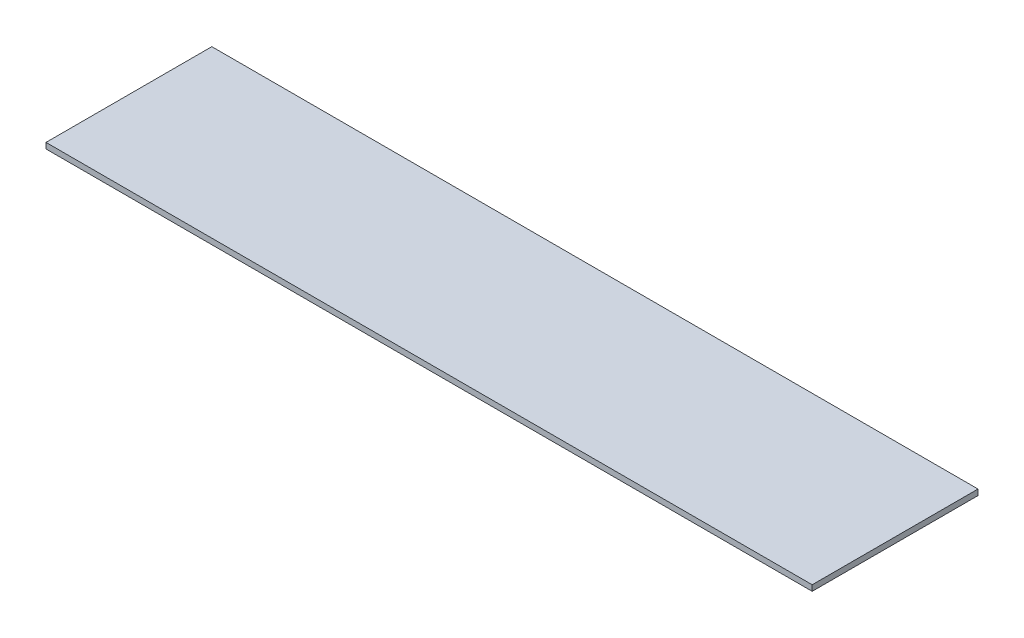
ISO-10303-21;
HEADER;
FILE_DESCRIPTION(('STEP AP214'),'2;1');
FILE_NAME('part.step','',(''),(''),'','','');
FILE_SCHEMA(('AUTOMOTIVE_DESIGN { 1 0 10303 214 1 1 1 1 }'));
ENDSEC;
DATA;
#1=APPLICATION_CONTEXT('core data for automotive mechanical design processes');
#2=APPLICATION_PROTOCOL_DEFINITION('international standard','automotive_design',2000,#1);
#3=PRODUCT_CONTEXT('',#1,'mechanical');
#4=PRODUCT('Part','Part','',(#3));
#5=PRODUCT_RELATED_PRODUCT_CATEGORY('part','',(#4));
#6=PRODUCT_DEFINITION_FORMATION('','',#4);
#7=PRODUCT_DEFINITION_CONTEXT('part definition',#1,'design');
#8=PRODUCT_DEFINITION('design','',#6,#7);
#9=PRODUCT_DEFINITION_SHAPE('','',#8);
#10=(LENGTH_UNIT() NAMED_UNIT(*) SI_UNIT(.MILLI.,.METRE.));
#11=(NAMED_UNIT(*) PLANE_ANGLE_UNIT() SI_UNIT($,.RADIAN.));
#12=(NAMED_UNIT(*) SI_UNIT($,.STERADIAN.) SOLID_ANGLE_UNIT());
#13=UNCERTAINTY_MEASURE_WITH_UNIT(LENGTH_MEASURE(1.E-05),#10,'distance_accuracy_value','');
#14=(GEOMETRIC_REPRESENTATION_CONTEXT(3) GLOBAL_UNCERTAINTY_ASSIGNED_CONTEXT((#13)) GLOBAL_UNIT_ASSIGNED_CONTEXT((#10,
#11,#12)) REPRESENTATION_CONTEXT('',''));
#15=CARTESIAN_POINT('',(0.,0.,0.));
#16=DIRECTION('',(0.,0.,1.));
#17=DIRECTION('',(1.,0.,0.));
#18=AXIS2_PLACEMENT_3D('',#15,#16,#17);
#19=CARTESIAN_POINT('',(-1303.89587580367,6.64285714285715,290.));
#20=DIRECTION('',(1.,0.,0.));
#21=DIRECTION('',(0.,0.,-1.));
#22=AXIS2_PLACEMENT_3D('',#19,#20,#21);
#23=PLANE('',#22);
#24=DIRECTION('',(0.,-1.,0.));
#25=VECTOR('',#24,1.);
#26=CARTESIAN_POINT('',(-1303.89587580367,6.64285714285715,0.));
#27=LINE('',#26,#25);
#28=CARTESIAN_POINT('',(-1303.89587580367,6.64285714285715,0.));
#29=VERTEX_POINT('',#28);
#30=CARTESIAN_POINT('',(-1303.89587580367,-3.35714285714286,0.));
#31=VERTEX_POINT('',#30);
#32=EDGE_CURVE('E96',#29,#31,#27,.T.);
#33=ORIENTED_EDGE('',*,*,#32,.T.);
#34=DIRECTION('',(0.,0.,-1.));
#35=VECTOR('',#34,1.);
#36=CARTESIAN_POINT('',(-1303.89587580367,-3.35714285714286,290.));
#37=LINE('',#36,#35);
#38=CARTESIAN_POINT('',(-1303.89587580367,-3.35714285714286,290.));
#39=VERTEX_POINT('',#38);
#40=EDGE_CURVE('E11',#39,#31,#37,.T.);
#41=ORIENTED_EDGE('',*,*,#40,.F.);
#42=DIRECTION('',(0.,-1.,0.));
#43=VECTOR('',#42,1.);
#44=CARTESIAN_POINT('',(-1303.89587580367,6.64285714285715,290.));
#45=LINE('',#44,#43);
#46=CARTESIAN_POINT('',(-1303.89587580367,6.64285714285715,290.));
#47=VERTEX_POINT('',#46);
#48=EDGE_CURVE('E82',#47,#39,#45,.T.);
#49=ORIENTED_EDGE('',*,*,#48,.F.);
#50=DIRECTION('',(0.,0.,-1.));
#51=VECTOR('',#50,1.);
#52=CARTESIAN_POINT('',(-1303.89587580367,6.64285714285715,290.));
#53=LINE('',#52,#51);
#54=EDGE_CURVE('E49',#47,#29,#53,.T.);
#55=ORIENTED_EDGE('',*,*,#54,.T.);
#56=EDGE_LOOP('',(#33,#41,#49,#55));
#57=FACE_BOUND('',#56,.T.);
#58=ADVANCED_FACE('F33',(#57),#23,.F.);
#59=CARTESIAN_POINT('',(-1303.89587580367,-3.35714285714286,290.));
#60=DIRECTION('',(0.,1.,0.));
#61=DIRECTION('',(0.,0.,1.));
#62=AXIS2_PLACEMENT_3D('',#59,#60,#61);
#63=PLANE('',#62);
#64=DIRECTION('',(1.,0.,0.));
#65=VECTOR('',#64,1.);
#66=CARTESIAN_POINT('',(-1303.89587580367,-3.35714285714286,0.));
#67=LINE('',#66,#65);
#68=CARTESIAN_POINT('',(36.1041241963306,-3.35714285714286,0.));
#69=VERTEX_POINT('',#68);
#70=EDGE_CURVE('E87',#31,#69,#67,.T.);
#71=ORIENTED_EDGE('',*,*,#70,.T.);
#72=DIRECTION('',(0.,0.,-1.));
#73=VECTOR('',#72,1.);
#74=CARTESIAN_POINT('',(36.1041241963306,-3.35714285714286,290.));
#75=LINE('',#74,#73);
#76=CARTESIAN_POINT('',(36.1041241963306,-3.35714285714286,290.));
#77=VERTEX_POINT('',#76);
#78=EDGE_CURVE('E41',#77,#69,#75,.T.);
#79=ORIENTED_EDGE('',*,*,#78,.F.);
#80=DIRECTION('',(1.,0.,0.));
#81=VECTOR('',#80,1.);
#82=CARTESIAN_POINT('',(-1303.89587580367,-3.35714285714286,290.));
#83=LINE('',#82,#81);
#84=EDGE_CURVE('E74',#39,#77,#83,.T.);
#85=ORIENTED_EDGE('',*,*,#84,.F.);
#86=ORIENTED_EDGE('',*,*,#40,.T.);
#87=EDGE_LOOP('',(#71,#79,#85,#86));
#88=FACE_BOUND('',#87,.T.);
#89=ADVANCED_FACE('F86',(#88),#63,.F.);
#90=CARTESIAN_POINT('',(36.1041241963306,6.64285714285715,290.));
#91=DIRECTION('',(1.,0.,0.));
#92=DIRECTION('',(0.,0.,-1.));
#93=AXIS2_PLACEMENT_3D('',#90,#91,#92);
#94=PLANE('',#93);
#95=DIRECTION('',(0.,-1.,0.));
#96=VECTOR('',#95,1.);
#97=CARTESIAN_POINT('',(36.1041241963306,6.64285714285715,0.));
#98=LINE('',#97,#96);
#99=CARTESIAN_POINT('',(36.1041241963306,6.64285714285715,0.));
#100=VERTEX_POINT('',#99);
#101=EDGE_CURVE('E99',#100,#69,#98,.T.);
#102=ORIENTED_EDGE('',*,*,#101,.F.);
#103=DIRECTION('',(0.,0.,-1.));
#104=VECTOR('',#103,1.);
#105=CARTESIAN_POINT('',(36.1041241963306,6.64285714285715,290.));
#106=LINE('',#105,#104);
#107=CARTESIAN_POINT('',(36.1041241963306,6.64285714285715,290.));
#108=VERTEX_POINT('',#107);
#109=EDGE_CURVE('E63',#108,#100,#106,.T.);
#110=ORIENTED_EDGE('',*,*,#109,.F.);
#111=DIRECTION('',(0.,-1.,0.));
#112=VECTOR('',#111,1.);
#113=CARTESIAN_POINT('',(36.1041241963306,6.64285714285715,290.));
#114=LINE('',#113,#112);
#115=EDGE_CURVE('E81',#108,#77,#114,.T.);
#116=ORIENTED_EDGE('',*,*,#115,.T.);
#117=ORIENTED_EDGE('',*,*,#78,.T.);
#118=EDGE_LOOP('',(#102,#110,#116,#117));
#119=FACE_BOUND('',#118,.T.);
#120=ADVANCED_FACE('F90',(#119),#94,.T.);
#121=CARTESIAN_POINT('',(-1303.89587580367,6.64285714285715,290.));
#122=DIRECTION('',(0.,1.,0.));
#123=DIRECTION('',(0.,0.,1.));
#124=AXIS2_PLACEMENT_3D('',#121,#122,#123);
#125=PLANE('',#124);
#126=DIRECTION('',(1.,0.,0.));
#127=VECTOR('',#126,1.);
#128=CARTESIAN_POINT('',(-1303.89587580367,6.64285714285715,0.));
#129=LINE('',#128,#127);
#130=EDGE_CURVE('E101',#29,#100,#129,.T.);
#131=ORIENTED_EDGE('',*,*,#130,.F.);
#132=ORIENTED_EDGE('',*,*,#54,.F.);
#133=DIRECTION('',(1.,0.,0.));
#134=VECTOR('',#133,1.);
#135=CARTESIAN_POINT('',(-1303.89587580367,6.64285714285715,290.));
#136=LINE('',#135,#134);
#137=EDGE_CURVE('E91',#47,#108,#136,.T.);
#138=ORIENTED_EDGE('',*,*,#137,.T.);
#139=ORIENTED_EDGE('',*,*,#109,.T.);
#140=EDGE_LOOP('',(#131,#132,#138,#139));
#141=FACE_BOUND('',#140,.T.);
#142=ADVANCED_FACE('F107',(#141),#125,.T.);
#143=CARTESIAN_POINT('',(0.,0.,290.));
#144=DIRECTION('',(0.,0.,1.));
#145=DIRECTION('',(1.,0.,0.));
#146=AXIS2_PLACEMENT_3D('',#143,#144,#145);
#147=PLANE('',#146);
#148=ORIENTED_EDGE('',*,*,#48,.T.);
#149=ORIENTED_EDGE('',*,*,#84,.T.);
#150=ORIENTED_EDGE('',*,*,#115,.F.);
#151=ORIENTED_EDGE('',*,*,#137,.F.);
#152=EDGE_LOOP('',(#148,#149,#150,#151));
#153=FACE_BOUND('',#152,.T.);
#154=ADVANCED_FACE('F78',(#153),#147,.T.);
#155=CARTESIAN_POINT('',(0.,0.,0.));
#156=DIRECTION('',(0.,0.,1.));
#157=DIRECTION('',(1.,0.,0.));
#158=AXIS2_PLACEMENT_3D('',#155,#156,#157);
#159=PLANE('',#158);
#160=ORIENTED_EDGE('',*,*,#32,.F.);
#161=ORIENTED_EDGE('',*,*,#130,.T.);
#162=ORIENTED_EDGE('',*,*,#101,.T.);
#163=ORIENTED_EDGE('',*,*,#70,.F.);
#164=EDGE_LOOP('',(#160,#161,#162,#163));
#165=FACE_BOUND('',#164,.T.);
#166=ADVANCED_FACE('F106',(#165),#159,.F.);
#167=CLOSED_SHELL('',(#58,#89,#120,#142,#154,#166));
#168=MANIFOLD_SOLID_BREP('B2',#167);
#169=ADVANCED_BREP_SHAPE_REPRESENTATION('',(#18,#168),#14);
#170=SHAPE_DEFINITION_REPRESENTATION(#9,#169);
ENDSEC;
END-ISO-10303-21;
